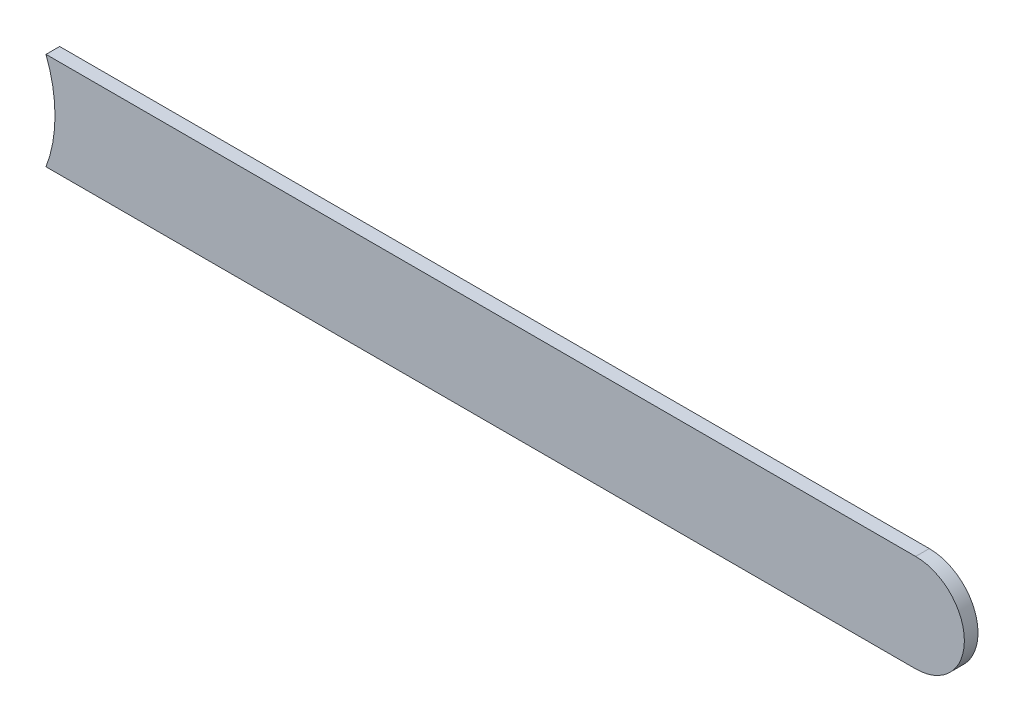
ISO-10303-21;
HEADER;
FILE_DESCRIPTION(('STEP AP214'),'2;1');
FILE_NAME('part.step','',(''),(''),'','','');
FILE_SCHEMA(('AUTOMOTIVE_DESIGN { 1 0 10303 214 1 1 1 1 }'));
ENDSEC;
DATA;
#1=APPLICATION_CONTEXT('core data for automotive mechanical design processes');
#2=APPLICATION_PROTOCOL_DEFINITION('international standard','automotive_design',2000,#1);
#3=PRODUCT_CONTEXT('',#1,'mechanical');
#4=PRODUCT('Part','Part','',(#3));
#5=PRODUCT_RELATED_PRODUCT_CATEGORY('part','',(#4));
#6=PRODUCT_DEFINITION_FORMATION('','',#4);
#7=PRODUCT_DEFINITION_CONTEXT('part definition',#1,'design');
#8=PRODUCT_DEFINITION('design','',#6,#7);
#9=PRODUCT_DEFINITION_SHAPE('','',#8);
#10=(LENGTH_UNIT() NAMED_UNIT(*) SI_UNIT(.MILLI.,.METRE.));
#11=(NAMED_UNIT(*) PLANE_ANGLE_UNIT() SI_UNIT($,.RADIAN.));
#12=(NAMED_UNIT(*) SI_UNIT($,.STERADIAN.) SOLID_ANGLE_UNIT());
#13=UNCERTAINTY_MEASURE_WITH_UNIT(LENGTH_MEASURE(1.E-05),#10,'distance_accuracy_value','');
#14=(GEOMETRIC_REPRESENTATION_CONTEXT(3) GLOBAL_UNCERTAINTY_ASSIGNED_CONTEXT((#13)) GLOBAL_UNIT_ASSIGNED_CONTEXT((#10,
#11,#12)) REPRESENTATION_CONTEXT('',''));
#15=CARTESIAN_POINT('',(0.,0.,0.));
#16=DIRECTION('',(0.,0.,1.));
#17=DIRECTION('',(1.,0.,0.));
#18=AXIS2_PLACEMENT_3D('',#15,#16,#17);
#19=CARTESIAN_POINT('',(78.1491197194978,79.55997296,0.));
#20=DIRECTION('',(0.,1.,0.));
#21=DIRECTION('',(1.,0.,0.));
#22=AXIS2_PLACEMENT_3D('',#19,#20,#21);
#23=PLANE('',#22);
#24=DIRECTION('',(1.,0.,0.));
#25=VECTOR('',#24,1.);
#26=CARTESIAN_POINT('',(77.81697162,79.55997296,0.03556));
#27=LINE('',#26,#25);
#28=CARTESIAN_POINT('',(78.1491197194978,79.55997296,0.03556));
#29=VERTEX_POINT('',#28);
#30=CARTESIAN_POINT('',(80.4169715,79.55997296,0.03556));
#31=VERTEX_POINT('',#30);
#32=EDGE_CURVE('E11',#29,#31,#27,.T.);
#33=ORIENTED_EDGE('',*,*,#32,.F.);
#34=DIRECTION('',(0.,0.,1.));
#35=VECTOR('',#34,1.);
#36=CARTESIAN_POINT('',(78.1491197194978,79.55997296,0.));
#37=LINE('',#36,#35);
#38=CARTESIAN_POINT('',(78.1491197194978,79.55997296,0.));
#39=VERTEX_POINT('',#38);
#40=EDGE_CURVE('E24',#39,#29,#37,.T.);
#41=ORIENTED_EDGE('',*,*,#40,.F.);
#42=DIRECTION('',(1.,0.,0.));
#43=VECTOR('',#42,1.);
#44=CARTESIAN_POINT('',(77.81697162,79.55997296,0.));
#45=LINE('',#44,#43);
#46=CARTESIAN_POINT('',(80.4169715,79.55997296,0.));
#47=VERTEX_POINT('',#46);
#48=EDGE_CURVE('E82',#39,#47,#45,.T.);
#49=ORIENTED_EDGE('',*,*,#48,.T.);
#50=DIRECTION('',(0.,0.,1.));
#51=VECTOR('',#50,1.);
#52=CARTESIAN_POINT('',(80.4169715,79.55997296,0.));
#53=LINE('',#52,#51);
#54=EDGE_CURVE('E37',#47,#31,#53,.T.);
#55=ORIENTED_EDGE('',*,*,#54,.T.);
#56=EDGE_LOOP('',(#33,#41,#49,#55));
#57=FACE_BOUND('',#56,.T.);
#58=ADVANCED_FACE('F17',(#57),#23,.F.);
#59=CARTESIAN_POINT('',(80.4169715,79.68697296,0.));
#60=DIRECTION('',(0.,0.,-1.));
#61=DIRECTION('',(1.11896493820492E-13,-1.,0.));
#62=AXIS2_PLACEMENT_3D('',#59,#60,#61);
#63=CYLINDRICAL_SURFACE('',#62,0.127000000000005);
#64=CARTESIAN_POINT('',(80.4169715,79.68697296,0.03556));
#65=DIRECTION('',(0.,0.,1.));
#66=DIRECTION('',(1.11896493820492E-13,-1.,0.));
#67=AXIS2_PLACEMENT_3D('',#64,#65,#66);
#68=CIRCLE('',#67,0.127000000000005);
#69=CARTESIAN_POINT('',(80.4169715,79.81397296,0.03556));
#70=VERTEX_POINT('',#69);
#71=EDGE_CURVE('E97',#31,#70,#68,.T.);
#72=ORIENTED_EDGE('',*,*,#71,.F.);
#73=ORIENTED_EDGE('',*,*,#54,.F.);
#74=CARTESIAN_POINT('',(80.4169715,79.68697296,0.));
#75=DIRECTION('',(0.,0.,1.));
#76=DIRECTION('',(1.11896493820492E-13,-1.,0.));
#77=AXIS2_PLACEMENT_3D('',#74,#75,#76);
#78=CIRCLE('',#77,0.127000000000005);
#79=CARTESIAN_POINT('',(80.4169715,79.81397296,0.));
#80=VERTEX_POINT('',#79);
#81=EDGE_CURVE('E94',#47,#80,#78,.T.);
#82=ORIENTED_EDGE('',*,*,#81,.T.);
#83=DIRECTION('',(0.,0.,1.));
#84=VECTOR('',#83,1.);
#85=CARTESIAN_POINT('',(80.4169715,79.81397296,0.));
#86=LINE('',#85,#84);
#87=EDGE_CURVE('E92',#80,#70,#86,.T.);
#88=ORIENTED_EDGE('',*,*,#87,.T.);
#89=EDGE_LOOP('',(#72,#73,#82,#88));
#90=FACE_BOUND('',#89,.T.);
#91=ADVANCED_FACE('F103',(#90),#63,.T.);
#92=CARTESIAN_POINT('',(80.4169715,79.81397296,0.));
#93=DIRECTION('',(0.,-1.,0.));
#94=DIRECTION('',(-1.,0.,0.));
#95=AXIS2_PLACEMENT_3D('',#92,#93,#94);
#96=PLANE('',#95);
#97=DIRECTION('',(-1.,0.,0.));
#98=VECTOR('',#97,1.);
#99=CARTESIAN_POINT('',(80.4169715,79.81397296,0.03556));
#100=LINE('',#99,#98);
#101=CARTESIAN_POINT('',(78.1491197194978,79.81397296,0.03556));
#102=VERTEX_POINT('',#101);
#103=EDGE_CURVE('E89',#70,#102,#100,.T.);
#104=ORIENTED_EDGE('',*,*,#103,.F.);
#105=ORIENTED_EDGE('',*,*,#87,.F.);
#106=DIRECTION('',(-1.,0.,0.));
#107=VECTOR('',#106,1.);
#108=CARTESIAN_POINT('',(80.4169715,79.81397296,0.));
#109=LINE('',#108,#107);
#110=CARTESIAN_POINT('',(78.1491197194978,79.81397296,0.));
#111=VERTEX_POINT('',#110);
#112=EDGE_CURVE('E87',#80,#111,#109,.T.);
#113=ORIENTED_EDGE('',*,*,#112,.T.);
#114=DIRECTION('',(0.,0.,1.));
#115=VECTOR('',#114,1.);
#116=CARTESIAN_POINT('',(78.1491197194978,79.81397296,0.));
#117=LINE('',#116,#115);
#118=EDGE_CURVE('E69',#111,#102,#117,.T.);
#119=ORIENTED_EDGE('',*,*,#118,.T.);
#120=EDGE_LOOP('',(#104,#105,#113,#119));
#121=FACE_BOUND('',#120,.T.);
#122=ADVANCED_FACE('F108',(#121),#96,.F.);
#123=CARTESIAN_POINT('',(77.81697162,79.68697296,0.));
#124=DIRECTION('',(0.,0.,-1.));
#125=DIRECTION('',(1.,0.,0.));
#126=AXIS2_PLACEMENT_3D('',#123,#124,#125);
#127=CYLINDRICAL_SURFACE('',#126,0.3556);
#128=DIRECTION('',(0.,0.,1.));
#129=VECTOR('',#128,1.);
#130=CARTESIAN_POINT('',(78.17257162,79.68697296,0.));
#131=LINE('',#130,#129);
#132=CARTESIAN_POINT('',(78.17257162,79.68697296,0.));
#133=VERTEX_POINT('',#132);
#134=CARTESIAN_POINT('',(78.17257162,79.68697296,0.03556));
#135=VERTEX_POINT('',#134);
#136=EDGE_CURVE('E59',#133,#135,#131,.T.);
#137=ORIENTED_EDGE('',*,*,#136,.T.);
#138=CARTESIAN_POINT('',(77.81697162,79.68697296,0.03556));
#139=DIRECTION('',(0.,0.,1.));
#140=DIRECTION('',(1.,0.,0.));
#141=AXIS2_PLACEMENT_3D('',#138,#139,#140);
#142=CIRCLE('',#141,0.3556);
#143=EDGE_CURVE('E70',#135,#102,#142,.T.);
#144=ORIENTED_EDGE('',*,*,#143,.T.);
#145=ORIENTED_EDGE('',*,*,#118,.F.);
#146=CARTESIAN_POINT('',(77.81697162,79.68697296,0.));
#147=DIRECTION('',(0.,0.,1.));
#148=DIRECTION('',(1.,0.,0.));
#149=AXIS2_PLACEMENT_3D('',#146,#147,#148);
#150=CIRCLE('',#149,0.3556);
#151=EDGE_CURVE('E73',#133,#111,#150,.T.);
#152=ORIENTED_EDGE('',*,*,#151,.F.);
#153=EDGE_LOOP('',(#137,#144,#145,#152));
#154=FACE_BOUND('',#153,.T.);
#155=ADVANCED_FACE('F74',(#154),#127,.F.);
#156=CARTESIAN_POINT('',(77.81697162,79.68697296,0.));
#157=DIRECTION('',(0.,0.,-1.));
#158=DIRECTION('',(1.,0.,0.));
#159=AXIS2_PLACEMENT_3D('',#156,#157,#158);
#160=CYLINDRICAL_SURFACE('',#159,0.3556);
#161=ORIENTED_EDGE('',*,*,#40,.T.);
#162=CARTESIAN_POINT('',(77.81697162,79.68697296,0.03556));
#163=DIRECTION('',(0.,0.,1.));
#164=DIRECTION('',(1.,0.,0.));
#165=AXIS2_PLACEMENT_3D('',#162,#163,#164);
#166=CIRCLE('',#165,0.3556);
#167=EDGE_CURVE('E65',#29,#135,#166,.T.);
#168=ORIENTED_EDGE('',*,*,#167,.T.);
#169=ORIENTED_EDGE('',*,*,#136,.F.);
#170=EDGE_CURVE('E63',#39,#133,#150,.T.);
#171=ORIENTED_EDGE('',*,*,#170,.F.);
#172=EDGE_LOOP('',(#161,#168,#169,#171));
#173=FACE_BOUND('',#172,.T.);
#174=ADVANCED_FACE('F61',(#173),#160,.F.);
#175=CARTESIAN_POINT('',(77.81697162,79.55997296,0.));
#176=DIRECTION('',(0.,0.,-1.));
#177=DIRECTION('',(-1.,0.,0.));
#178=AXIS2_PLACEMENT_3D('',#175,#176,#177);
#179=PLANE('',#178);
#180=ORIENTED_EDGE('',*,*,#48,.F.);
#181=ORIENTED_EDGE('',*,*,#170,.T.);
#182=ORIENTED_EDGE('',*,*,#151,.T.);
#183=ORIENTED_EDGE('',*,*,#112,.F.);
#184=ORIENTED_EDGE('',*,*,#81,.F.);
#185=EDGE_LOOP('',(#180,#181,#182,#183,#184));
#186=FACE_BOUND('',#185,.T.);
#187=ADVANCED_FACE('F80',(#186),#179,.T.);
#188=CARTESIAN_POINT('',(77.81697162,79.55997296,0.03556));
#189=DIRECTION('',(0.,0.,-1.));
#190=DIRECTION('',(-1.,0.,0.));
#191=AXIS2_PLACEMENT_3D('',#188,#189,#190);
#192=PLANE('',#191);
#193=ORIENTED_EDGE('',*,*,#167,.F.);
#194=ORIENTED_EDGE('',*,*,#32,.T.);
#195=ORIENTED_EDGE('',*,*,#71,.T.);
#196=ORIENTED_EDGE('',*,*,#103,.T.);
#197=ORIENTED_EDGE('',*,*,#143,.F.);
#198=EDGE_LOOP('',(#193,#194,#195,#196,#197));
#199=FACE_BOUND('',#198,.T.);
#200=ADVANCED_FACE('F106',(#199),#192,.F.);
#201=CLOSED_SHELL('',(#58,#91,#122,#155,#174,#187,#200));
#202=MANIFOLD_SOLID_BREP('B1',#201);
#203=ADVANCED_BREP_SHAPE_REPRESENTATION('',(#18,#202),#14);
#204=SHAPE_DEFINITION_REPRESENTATION(#9,#203);
ENDSEC;
END-ISO-10303-21;
